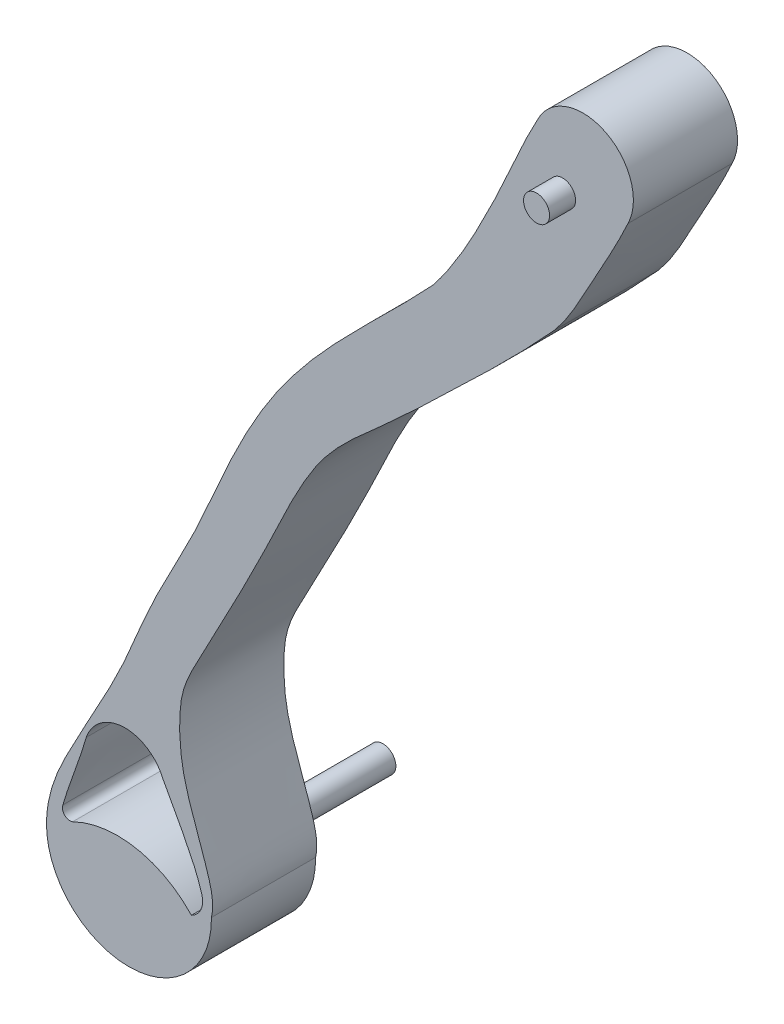
ISO-10303-21;
HEADER;
FILE_DESCRIPTION(('STEP AP214'),'2;1');
FILE_NAME('part.step','',(''),(''),'','','');
FILE_SCHEMA(('AUTOMOTIVE_DESIGN { 1 0 10303 214 1 1 1 1 }'));
ENDSEC;
DATA;
#1=APPLICATION_CONTEXT('core data for automotive mechanical design processes');
#2=APPLICATION_PROTOCOL_DEFINITION('international standard','automotive_design',2000,#1);
#3=PRODUCT_CONTEXT('',#1,'mechanical');
#4=PRODUCT('Part','Part','',(#3));
#5=PRODUCT_RELATED_PRODUCT_CATEGORY('part','',(#4));
#6=PRODUCT_DEFINITION_FORMATION('','',#4);
#7=PRODUCT_DEFINITION_CONTEXT('part definition',#1,'design');
#8=PRODUCT_DEFINITION('design','',#6,#7);
#9=PRODUCT_DEFINITION_SHAPE('','',#8);
#10=(LENGTH_UNIT() NAMED_UNIT(*) SI_UNIT(.MILLI.,.METRE.));
#11=(NAMED_UNIT(*) PLANE_ANGLE_UNIT() SI_UNIT($,.RADIAN.));
#12=(NAMED_UNIT(*) SI_UNIT($,.STERADIAN.) SOLID_ANGLE_UNIT());
#13=UNCERTAINTY_MEASURE_WITH_UNIT(LENGTH_MEASURE(1.E-05),#10,'distance_accuracy_value','');
#14=(GEOMETRIC_REPRESENTATION_CONTEXT(3) GLOBAL_UNCERTAINTY_ASSIGNED_CONTEXT((#13)) GLOBAL_UNIT_ASSIGNED_CONTEXT((#10,
#11,#12)) REPRESENTATION_CONTEXT('',''));
#15=CARTESIAN_POINT('',(0.,0.,0.));
#16=DIRECTION('',(0.,0.,1.));
#17=DIRECTION('',(1.,0.,0.));
#18=AXIS2_PLACEMENT_3D('',#15,#16,#17);
#19=CARTESIAN_POINT('',(60.3871939047688,187.542653548345,40.));
#20=CARTESIAN_POINT('',(55.8290363319542,179.301734235559,40.));
#21=CARTESIAN_POINT('',(48.5414420568133,162.180154607275,40.));
#22=CARTESIAN_POINT('',(36.0717803356837,136.393112865511,40.));
#23=CARTESIAN_POINT('',(26.2480929802239,119.800552758437,40.));
#24=CARTESIAN_POINT('',(19.9390279093565,111.952234191218,40.));
#25=B_SPLINE_CURVE_WITH_KNOTS('',3,(#19,#20,#21,#22,#23,#24),.UNSPECIFIED.,.F.,.F.,(4,1,1,4),
(0.,0.328457342126974,0.649354288135533,1.),.UNSPECIFIED.);
#26=DIRECTION('',(0.,0.,-1.));
#27=VECTOR('',#26,1.);
#28=SURFACE_OF_LINEAR_EXTRUSION('',#25,#27);
#29=CARTESIAN_POINT('',(60.3871939047688,187.542653548345,0.));
#30=CARTESIAN_POINT('',(55.8290363319542,179.301734235559,0.));
#31=CARTESIAN_POINT('',(48.5414420568133,162.180154607275,0.));
#32=CARTESIAN_POINT('',(36.0717803356837,136.393112865511,0.));
#33=CARTESIAN_POINT('',(26.2480929802239,119.800552758437,0.));
#34=CARTESIAN_POINT('',(19.9390279093565,111.952234191218,0.));
#35=B_SPLINE_CURVE_WITH_KNOTS('',3,(#29,#30,#31,#32,#33,#34),.UNSPECIFIED.,.F.,.F.,(4,1,1,4),
(0.,0.328457342126974,0.649354288135533,1.),.UNSPECIFIED.);
#36=CARTESIAN_POINT('',(60.3871939047688,187.542653548345,0.));
#37=VERTEX_POINT('',#36);
#38=CARTESIAN_POINT('',(19.9390279093565,111.952234191218,0.));
#39=VERTEX_POINT('',#38);
#40=EDGE_CURVE('E219',#37,#39,#35,.T.);
#41=ORIENTED_EDGE('',*,*,#40,.T.);
#42=DIRECTION('',(0.,0.,-1.));
#43=VECTOR('',#42,1.);
#44=CARTESIAN_POINT('',(19.9390279093565,111.952234191218,40.));
#45=LINE('',#44,#43);
#46=CARTESIAN_POINT('',(19.9390279093565,111.952234191218,40.));
#47=VERTEX_POINT('',#46);
#48=EDGE_CURVE('E279',#47,#39,#45,.T.);
#49=ORIENTED_EDGE('',*,*,#48,.F.);
#50=CARTESIAN_POINT('',(60.3871939047688,187.542653548345,40.));
#51=VERTEX_POINT('',#50);
#52=EDGE_CURVE('E259',#51,#47,#25,.T.);
#53=ORIENTED_EDGE('',*,*,#52,.F.);
#54=DIRECTION('',(0.,0.,-1.));
#55=VECTOR('',#54,1.);
#56=CARTESIAN_POINT('',(60.3871939047688,187.542653548345,40.));
#57=LINE('',#56,#55);
#58=EDGE_CURVE('E218',#51,#37,#57,.T.);
#59=ORIENTED_EDGE('',*,*,#58,.T.);
#60=EDGE_LOOP('',(#41,#49,#53,#59));
#61=FACE_BOUND('',#60,.T.);
#62=ADVANCED_FACE('F41',(#61),#28,.F.);
#63=CARTESIAN_POINT('',(19.9390279093565,111.952234191218,40.));
#64=CARTESIAN_POINT('',(3.65232556956879,94.3290387479032,40.));
#65=CARTESIAN_POINT('',(-20.2496056722117,73.6219313673964,40.));
#66=CARTESIAN_POINT('',(-45.6524290616376,39.0411420736974,40.));
#67=CARTESIAN_POINT('',(-58.8426468973011,13.6097033064801,40.));
#68=CARTESIAN_POINT('',(-71.7894873232042,-18.0719905640691,40.));
#69=CARTESIAN_POINT('',(-87.738861669202,-45.500334261071,40.));
#70=CARTESIAN_POINT('',(-100.863433522927,-79.9213549862569,40.));
#71=CARTESIAN_POINT('',(-115.452059141126,-103.788445803052,40.));
#72=CARTESIAN_POINT('',(-126.143907941595,-125.769991296804,40.));
#73=CARTESIAN_POINT('',(-128.340182149036,-135.353702394417,40.));
#74=CARTESIAN_POINT('',(-128.435303346591,-140.896902452704,40.));
#75=B_SPLINE_CURVE_WITH_KNOTS('',3,(#63,#64,#65,#66,#67,#68,#69,#70,#71,#72,#73,#74),
.UNSPECIFIED.,.F.,.F.,(4,1,1,1,1,1,1,1,1,4),(0.,0.227860935563209,0.297082932040431,
0.405625713010245,0.49841550509689,0.621398377971298,0.705377541129316,0.846798383266303,
0.885360920028116,0.937345031613258),.UNSPECIFIED.);
#76=DIRECTION('',(0.,0.,-1.));
#77=VECTOR('',#76,1.);
#78=SURFACE_OF_LINEAR_EXTRUSION('',#75,#77);
#79=CARTESIAN_POINT('',(19.9390279093565,111.952234191218,0.));
#80=CARTESIAN_POINT('',(3.65232556956879,94.3290387479032,0.));
#81=CARTESIAN_POINT('',(-20.2496056722117,73.6219313673964,0.));
#82=CARTESIAN_POINT('',(-45.6524290616376,39.0411420736974,0.));
#83=CARTESIAN_POINT('',(-58.8426468973011,13.6097033064801,0.));
#84=CARTESIAN_POINT('',(-71.7894873232042,-18.0719905640691,0.));
#85=CARTESIAN_POINT('',(-87.738861669202,-45.500334261071,0.));
#86=CARTESIAN_POINT('',(-100.863433522927,-79.9213549862569,0.));
#87=CARTESIAN_POINT('',(-115.452059141126,-103.788445803052,0.));
#88=CARTESIAN_POINT('',(-126.143907941595,-125.769991296804,0.));
#89=CARTESIAN_POINT('',(-128.340182149036,-135.353702394417,0.));
#90=CARTESIAN_POINT('',(-128.435303346591,-140.896902452704,0.));
#91=B_SPLINE_CURVE_WITH_KNOTS('',3,(#79,#80,#81,#82,#83,#84,#85,#86,#87,#88,#89,#90),
.UNSPECIFIED.,.F.,.F.,(4,1,1,1,1,1,1,1,1,4),(0.,0.227860935563209,0.297082932040431,
0.405625713010245,0.49841550509689,0.621398377971298,0.705377541129316,0.846798383266303,
0.885360920028116,0.937345031613258),.UNSPECIFIED.);
#92=CARTESIAN_POINT('',(-128.435303346591,-140.896902452704,0.));
#93=VERTEX_POINT('',#92);
#94=EDGE_CURVE('E225',#39,#93,#91,.T.);
#95=ORIENTED_EDGE('',*,*,#94,.T.);
#96=DIRECTION('',(0.,0.,-1.));
#97=VECTOR('',#96,1.);
#98=CARTESIAN_POINT('',(-128.435303346591,-140.896902452704,40.));
#99=LINE('',#98,#97);
#100=CARTESIAN_POINT('',(-128.435303346591,-140.896902452704,40.));
#101=VERTEX_POINT('',#100);
#102=EDGE_CURVE('E275',#101,#93,#99,.T.);
#103=ORIENTED_EDGE('',*,*,#102,.F.);
#104=EDGE_CURVE('E320',#47,#101,#75,.T.);
#105=ORIENTED_EDGE('',*,*,#104,.F.);
#106=ORIENTED_EDGE('',*,*,#48,.T.);
#107=EDGE_LOOP('',(#95,#103,#105,#106));
#108=FACE_BOUND('',#107,.T.);
#109=ADVANCED_FACE('F319',(#108),#78,.F.);
#110=CARTESIAN_POINT('',(-96.7551495256795,-141.440533232487,40.));
#111=DIRECTION('',(0.,0.,-1.));
#112=DIRECTION('',(-1.,0.,0.));
#113=AXIS2_PLACEMENT_3D('',#110,#111,#112);
#114=CYLINDRICAL_SURFACE('',#113,31.6848178240202);
#115=CARTESIAN_POINT('',(-96.7551495256795,-141.440533232487,0.));
#116=DIRECTION('',(0.,0.,1.));
#117=DIRECTION('',(1.,0.,0.));
#118=AXIS2_PLACEMENT_3D('',#115,#116,#117);
#119=CIRCLE('',#118,31.6848178240202);
#120=CARTESIAN_POINT('',(-65.0749957047679,-140.896902452704,0.));
#121=VERTEX_POINT('',#120);
#122=EDGE_CURVE('E234',#93,#121,#119,.T.);
#123=ORIENTED_EDGE('',*,*,#122,.T.);
#124=DIRECTION('',(0.,0.,-1.));
#125=VECTOR('',#124,1.);
#126=CARTESIAN_POINT('',(-65.0749957047679,-140.896902452704,40.));
#127=LINE('',#126,#125);
#128=CARTESIAN_POINT('',(-65.0749957047679,-140.896902452704,40.));
#129=VERTEX_POINT('',#128);
#130=EDGE_CURVE('E271',#129,#121,#127,.T.);
#131=ORIENTED_EDGE('',*,*,#130,.F.);
#132=CARTESIAN_POINT('',(-96.7551495256795,-141.440533232487,40.));
#133=DIRECTION('',(0.,0.,1.));
#134=DIRECTION('',(1.,0.,0.));
#135=AXIS2_PLACEMENT_3D('',#132,#133,#134);
#136=CIRCLE('',#135,31.6848178240202);
#137=EDGE_CURVE('E316',#101,#129,#136,.T.);
#138=ORIENTED_EDGE('',*,*,#137,.F.);
#139=ORIENTED_EDGE('',*,*,#102,.T.);
#140=EDGE_LOOP('',(#123,#131,#138,#139));
#141=FACE_BOUND('',#140,.T.);
#142=ADVANCED_FACE('F315',(#141),#114,.T.);
#143=CARTESIAN_POINT('',(-65.0749957047679,-140.896902452704,40.));
#144=CARTESIAN_POINT('',(-63.9076520974631,-135.874645519981,40.));
#145=CARTESIAN_POINT('',(-66.351009120268,-126.659238678966,40.));
#146=CARTESIAN_POINT('',(-71.697657004547,-112.128089654056,40.));
#147=CARTESIAN_POINT('',(-76.3347123156339,-98.4722093976341,40.));
#148=CARTESIAN_POINT('',(-77.5417094464005,-84.2071987317642,40.));
#149=CARTESIAN_POINT('',(-76.9619608186878,-70.3420925391163,40.));
#150=CARTESIAN_POINT('',(-68.8857927603554,-55.6949594400587,40.));
#151=CARTESIAN_POINT('',(-58.2138452567508,-35.3055248491132,40.));
#152=CARTESIAN_POINT('',(-45.109839413962,-10.2853251386272,40.));
#153=CARTESIAN_POINT('',(-33.8512418556575,14.9392911187335,40.));
#154=CARTESIAN_POINT('',(-19.441261207989,38.761764832245,40.));
#155=CARTESIAN_POINT('',(0.346111339632618,54.84625305736,40.));
#156=CARTESIAN_POINT('',(30.1496907967711,83.3530804332558,40.));
#157=CARTESIAN_POINT('',(52.0052503732417,104.15599097624,40.));
#158=CARTESIAN_POINT('',(66.8758658751505,120.550338304471,40.));
#159=B_SPLINE_CURVE_WITH_KNOTS('',3,(#143,#144,#145,#146,#147,#148,#149,#150,#151,#152,#153,
#154,#155,#156,#157,#158),.UNSPECIFIED.,.F.,.F.,(4,1,1,1,1,1,1,1,1,1,1,1,1,4),(0.,
0.046869520106327,0.0901417125794342,0.14858122636721,0.183456914359763,0.226900489242656,
0.278590853817405,0.340349479488274,0.448130788079936,0.547901996865662,0.604794059024926,
0.712230619265801,0.788345355237952,1.),.UNSPECIFIED.);
#160=DIRECTION('',(0.,0.,-1.));
#161=VECTOR('',#160,1.);
#162=SURFACE_OF_LINEAR_EXTRUSION('',#159,#161);
#163=CARTESIAN_POINT('',(-65.0749957047679,-140.896902452704,0.));
#164=CARTESIAN_POINT('',(-63.9076520974631,-135.874645519981,0.));
#165=CARTESIAN_POINT('',(-66.351009120268,-126.659238678966,0.));
#166=CARTESIAN_POINT('',(-71.697657004547,-112.128089654056,0.));
#167=CARTESIAN_POINT('',(-76.3347123156339,-98.4722093976341,0.));
#168=CARTESIAN_POINT('',(-77.5417094464005,-84.2071987317642,0.));
#169=CARTESIAN_POINT('',(-76.9619608186878,-70.3420925391163,0.));
#170=CARTESIAN_POINT('',(-68.8857927603554,-55.6949594400587,0.));
#171=CARTESIAN_POINT('',(-58.2138452567508,-35.3055248491132,0.));
#172=CARTESIAN_POINT('',(-45.109839413962,-10.2853251386272,0.));
#173=CARTESIAN_POINT('',(-33.8512418556575,14.9392911187335,0.));
#174=CARTESIAN_POINT('',(-19.441261207989,38.761764832245,0.));
#175=CARTESIAN_POINT('',(0.346111339632618,54.84625305736,0.));
#176=CARTESIAN_POINT('',(30.1496907967711,83.3530804332558,0.));
#177=CARTESIAN_POINT('',(52.0052503732417,104.15599097624,0.));
#178=CARTESIAN_POINT('',(66.8758658751505,120.550338304471,0.));
#179=B_SPLINE_CURVE_WITH_KNOTS('',3,(#163,#164,#165,#166,#167,#168,#169,#170,#171,#172,#173,
#174,#175,#176,#177,#178),.UNSPECIFIED.,.F.,.F.,(4,1,1,1,1,1,1,1,1,1,1,1,1,4),(0.,
0.046869520106327,0.0901417125794342,0.14858122636721,0.183456914359763,0.226900489242656,
0.278590853817405,0.340349479488274,0.448130788079936,0.547901996865662,0.604794059024926,
0.712230619265801,0.788345355237952,1.),.UNSPECIFIED.);
#180=CARTESIAN_POINT('',(66.8758658751505,120.550338304471,0.));
#181=VERTEX_POINT('',#180);
#182=EDGE_CURVE('E240',#121,#181,#179,.T.);
#183=ORIENTED_EDGE('',*,*,#182,.T.);
#184=DIRECTION('',(0.,0.,-1.));
#185=VECTOR('',#184,1.);
#186=CARTESIAN_POINT('',(66.8758658751505,120.550338304471,40.));
#187=LINE('',#186,#185);
#188=CARTESIAN_POINT('',(66.8758658751505,120.550338304471,40.));
#189=VERTEX_POINT('',#188);
#190=EDGE_CURVE('E267',#189,#181,#187,.T.);
#191=ORIENTED_EDGE('',*,*,#190,.F.);
#192=EDGE_CURVE('E208',#129,#189,#159,.T.);
#193=ORIENTED_EDGE('',*,*,#192,.F.);
#194=ORIENTED_EDGE('',*,*,#130,.T.);
#195=EDGE_LOOP('',(#183,#191,#193,#194));
#196=FACE_BOUND('',#195,.T.);
#197=ADVANCED_FACE('F197',(#196),#162,.F.);
#198=CARTESIAN_POINT('',(66.8758658751505,120.550338304471,40.));
#199=CARTESIAN_POINT('',(72.3865565632837,127.199137849792,40.));
#200=CARTESIAN_POINT('',(81.1017354369889,144.070801532341,40.));
#201=CARTESIAN_POINT('',(90.5875806479653,160.476032838296,40.));
#202=CARTESIAN_POINT('',(94.8964834466866,169.931016126953,40.));
#203=B_SPLINE_CURVE_WITH_KNOTS('',3,(#198,#199,#200,#201,#202),.UNSPECIFIED.,.F.,.F.,(4,1,4),
(0.,0.452321954450855,1.),.UNSPECIFIED.);
#204=DIRECTION('',(0.,0.,-1.));
#205=VECTOR('',#204,1.);
#206=SURFACE_OF_LINEAR_EXTRUSION('',#203,#205);
#207=CARTESIAN_POINT('',(66.8758658751505,120.550338304471,0.));
#208=CARTESIAN_POINT('',(72.3865565632837,127.199137849792,0.));
#209=CARTESIAN_POINT('',(81.1017354369889,144.070801532341,0.));
#210=CARTESIAN_POINT('',(90.5875806479653,160.476032838296,0.));
#211=CARTESIAN_POINT('',(94.8964834466866,169.931016126953,0.));
#212=B_SPLINE_CURVE_WITH_KNOTS('',3,(#207,#208,#209,#210,#211),.UNSPECIFIED.,.F.,.F.,(4,1,4),
(0.,0.452321954450855,1.),.UNSPECIFIED.);
#213=CARTESIAN_POINT('',(94.8964834466866,169.931016126953,0.));
#214=VERTEX_POINT('',#213);
#215=EDGE_CURVE('E245',#181,#214,#212,.T.);
#216=ORIENTED_EDGE('',*,*,#215,.T.);
#217=DIRECTION('',(0.,0.,-1.));
#218=VECTOR('',#217,1.);
#219=CARTESIAN_POINT('',(94.8964834466866,169.931016126953,40.));
#220=LINE('',#219,#218);
#221=CARTESIAN_POINT('',(94.8964834466866,169.931016126953,40.));
#222=VERTEX_POINT('',#221);
#223=EDGE_CURVE('E263',#222,#214,#220,.T.);
#224=ORIENTED_EDGE('',*,*,#223,.F.);
#225=EDGE_CURVE('E201',#189,#222,#203,.T.);
#226=ORIENTED_EDGE('',*,*,#225,.F.);
#227=ORIENTED_EDGE('',*,*,#190,.T.);
#228=EDGE_LOOP('',(#216,#224,#226,#227));
#229=FACE_BOUND('',#228,.T.);
#230=ADVANCED_FACE('F192',(#229),#206,.F.);
#231=CARTESIAN_POINT('',(77.6418386757277,178.736834837649,40.));
#232=DIRECTION('',(0.,0.,-1.));
#233=DIRECTION('',(-1.,0.,0.));
#234=AXIS2_PLACEMENT_3D('',#231,#232,#233);
#235=CYLINDRICAL_SURFACE('',#234,19.3717631964059);
#236=CARTESIAN_POINT('',(77.6418386757277,178.736834837649,0.));
#237=DIRECTION('',(0.,0.,1.));
#238=DIRECTION('',(1.,0.,0.));
#239=AXIS2_PLACEMENT_3D('',#236,#237,#238);
#240=CIRCLE('',#239,19.3717631964059);
#241=EDGE_CURVE('E253',#214,#37,#240,.T.);
#242=ORIENTED_EDGE('',*,*,#241,.T.);
#243=ORIENTED_EDGE('',*,*,#58,.F.);
#244=CARTESIAN_POINT('',(77.6418386757277,178.736834837649,40.));
#245=DIRECTION('',(0.,0.,1.));
#246=DIRECTION('',(1.,0.,0.));
#247=AXIS2_PLACEMENT_3D('',#244,#245,#246);
#248=CIRCLE('',#247,19.3717631964059);
#249=EDGE_CURVE('E207',#222,#51,#248,.T.);
#250=ORIENTED_EDGE('',*,*,#249,.F.);
#251=ORIENTED_EDGE('',*,*,#223,.T.);
#252=EDGE_LOOP('',(#242,#243,#250,#251));
#253=FACE_BOUND('',#252,.T.);
#254=ADVANCED_FACE('F186',(#253),#235,.T.);
#255=CARTESIAN_POINT('',(41.9594234862686,148.749008778062,40.));
#256=DIRECTION('',(0.,0.,-1.));
#257=DIRECTION('',(-1.,0.,0.));
#258=AXIS2_PLACEMENT_3D('',#255,#256,#257);
#259=PLANE('',#258);
#260=CARTESIAN_POINT('',(-98.2680109010432,-110.139148104307,40.));
#261=DIRECTION('',(0.,0.,-1.));
#262=DIRECTION('',(-1.,0.,0.));
#263=AXIS2_PLACEMENT_3D('',#260,#261,#262);
#264=CIRCLE('',#263,15.7577300745778);
#265=CARTESIAN_POINT('',(-113.174364561703,-105.029678694809,40.));
#266=VERTEX_POINT('',#265);
#267=CARTESIAN_POINT('',(-83.767621929173,-103.971103295154,40.));
#268=VERTEX_POINT('',#267);
#269=EDGE_CURVE('E140',#266,#268,#264,.T.);
#270=ORIENTED_EDGE('',*,*,#269,.T.);
#271=CARTESIAN_POINT('',(-83.767621929173,-103.971103295154,40.));
#272=CARTESIAN_POINT('',(-83.5873518221978,-104.298739765715,40.));
#273=CARTESIAN_POINT('',(-81.9140125138247,-107.339065994013,40.));
#274=CARTESIAN_POINT('',(-79.5056807611094,-111.713780783624,40.));
#275=CARTESIAN_POINT('',(-76.6247828079274,-117.103856722549,40.));
#276=CARTESIAN_POINT('',(-74.5149876082828,-121.165521306411,40.));
#277=CARTESIAN_POINT('',(-72.5233715707377,-125.181904734384,40.));
#278=CARTESIAN_POINT('',(-70.7511149933077,-129.174468609595,40.));
#279=CARTESIAN_POINT('',(-69.5361784966292,-132.477867127564,40.));
#280=CARTESIAN_POINT('',(-68.9335514776586,-134.470064330966,40.));
#281=CARTESIAN_POINT('',(-68.756079477371,-135.101198343125,40.));
#282=B_SPLINE_CURVE_WITH_KNOTS('',3,(#271,#272,#273,#274,#275,#276,#277,#278,#279,#280,#281),
.UNSPECIFIED.,.F.,.F.,(4,1,1,1,1,1,1,1,4),(0.78726205462932,0.790799640659053,0.820108718849894,
0.834763257945314,0.849417797040735,0.864072336136155,0.878726875231576,0.893381414326996,
0.900142659372409),.UNSPECIFIED.);
#283=CARTESIAN_POINT('',(-68.756079477371,-135.101198343125,40.));
#284=VERTEX_POINT('',#283);
#285=EDGE_CURVE('E133',#268,#284,#282,.T.);
#286=ORIENTED_EDGE('',*,*,#285,.T.);
#287=CARTESIAN_POINT('',(-76.0350356200496,-137.174185438122,40.));
#288=DIRECTION('',(0.,0.,-1.));
#289=DIRECTION('',(-1.,0.,0.));
#290=AXIS2_PLACEMENT_3D('',#287,#288,#289);
#291=CIRCLE('',#290,7.56838675168399);
#292=CARTESIAN_POINT('',(-72.7671763250433,-144.000719965326,40.));
#293=VERTEX_POINT('',#292);
#294=EDGE_CURVE('E143',#284,#293,#291,.T.);
#295=ORIENTED_EDGE('',*,*,#294,.T.);
#296=CARTESIAN_POINT('',(-101.151055014439,-170.490756136762,40.));
#297=DIRECTION('',(0.,0.,1.));
#298=DIRECTION('',(-1.,0.,0.));
#299=AXIS2_PLACEMENT_3D('',#296,#297,#298);
#300=CIRCLE('',#299,38.8248191987845);
#301=CARTESIAN_POINT('',(-118.409854589952,-135.71288353031,40.));
#302=VERTEX_POINT('',#301);
#303=EDGE_CURVE('E57',#293,#302,#300,.T.);
#304=ORIENTED_EDGE('',*,*,#303,.T.);
#305=CARTESIAN_POINT('',(-119.395416627931,-132.968075227075,40.));
#306=DIRECTION('',(0.,0.,-1.));
#307=DIRECTION('',(-1.,0.,0.));
#308=AXIS2_PLACEMENT_3D('',#305,#306,#307);
#309=CIRCLE('',#308,2.91638563160215);
#310=CARTESIAN_POINT('',(-122.117435387313,-131.921213714845,40.));
#311=VERTEX_POINT('',#310);
#312=EDGE_CURVE('E493',#302,#311,#309,.T.);
#313=ORIENTED_EDGE('',*,*,#312,.T.);
#314=CARTESIAN_POINT('',(-122.117435387313,-131.921213714845,40.));
#315=CARTESIAN_POINT('',(-121.902241698116,-131.121274345062,40.));
#316=CARTESIAN_POINT('',(-121.440830196153,-129.57026566349,40.));
#317=CARTESIAN_POINT('',(-120.671868024191,-127.192672605094,40.));
#318=CARTESIAN_POINT('',(-119.652569306588,-124.170271778331,40.));
#319=CARTESIAN_POINT('',(-118.30466128808,-120.363805325728,40.));
#320=CARTESIAN_POINT('',(-116.083389287069,-114.194015199901,40.));
#321=CARTESIAN_POINT('',(-114.313518516747,-109.046051234717,40.));
#322=CARTESIAN_POINT('',(-113.271974892819,-105.380725172154,40.));
#323=CARTESIAN_POINT('',(-113.174364561703,-105.029678694809,40.));
#324=B_SPLINE_CURVE_WITH_KNOTS('',3,(#314,#315,#316,#317,#318,#319,#320,#321,#322,#323),
.UNSPECIFIED.,.F.,.F.,(4,1,1,1,1,1,1,4),(0.0361999933541439,0.0449983752809423,
0.0528232545126927,0.0606481337444431,0.0762978922079439,0.0919476506714447,0.123247167598446,
0.126550228804812),.UNSPECIFIED.);
#325=EDGE_CURVE('E486',#311,#266,#324,.T.);
#326=ORIENTED_EDGE('',*,*,#325,.T.);
#327=EDGE_LOOP('',(#270,#286,#295,#304,#313,#326));
#328=FACE_BOUND('',#327,.T.);
#329=CARTESIAN_POINT('',(69.8193877085274,167.582956348483,40.));
#330=DIRECTION('',(0.,0.,-1.));
#331=DIRECTION('',(-1.,0.,0.));
#332=AXIS2_PLACEMENT_3D('',#329,#330,#331);
#333=CIRCLE('',#332,5.00000000000001);
#334=CARTESIAN_POINT('',(64.8193877085274,167.582956348483,40.));
#335=VERTEX_POINT('',#334);
#336=EDGE_CURVE('E283',#335,#335,#333,.F.);
#337=ORIENTED_EDGE('',*,*,#336,.F.);
#338=EDGE_LOOP('',(#337));
#339=FACE_BOUND('',#338,.T.);
#340=ORIENTED_EDGE('',*,*,#52,.T.);
#341=ORIENTED_EDGE('',*,*,#104,.T.);
#342=ORIENTED_EDGE('',*,*,#137,.T.);
#343=ORIENTED_EDGE('',*,*,#192,.T.);
#344=ORIENTED_EDGE('',*,*,#225,.T.);
#345=ORIENTED_EDGE('',*,*,#249,.T.);
#346=EDGE_LOOP('',(#340,#341,#342,#343,#344,#345));
#347=FACE_BOUND('',#346,.T.);
#348=ADVANCED_FACE('F148',(#328,#339,#347),#259,.F.);
#349=CARTESIAN_POINT('',(41.9594234862686,148.749008778062,0.));
#350=DIRECTION('',(0.,0.,-1.));
#351=DIRECTION('',(-1.,0.,0.));
#352=AXIS2_PLACEMENT_3D('',#349,#350,#351);
#353=PLANE('',#352);
#354=CARTESIAN_POINT('',(-99.2300932035587,-155.129512748989,0.));
#355=DIRECTION('',(0.,0.,-1.));
#356=DIRECTION('',(-1.,0.,0.));
#357=AXIS2_PLACEMENT_3D('',#354,#355,#356);
#358=CIRCLE('',#357,5.00000000000001);
#359=CARTESIAN_POINT('',(-104.230093203559,-155.129512748989,0.));
#360=VERTEX_POINT('',#359);
#361=EDGE_CURVE('E11',#360,#360,#358,.T.);
#362=ORIENTED_EDGE('',*,*,#361,.F.);
#363=EDGE_LOOP('',(#362));
#364=FACE_BOUND('',#363,.T.);
#365=CARTESIAN_POINT('',(69.8193877085274,167.582956348483,0.));
#366=DIRECTION('',(0.,0.,-1.));
#367=DIRECTION('',(-1.,0.,0.));
#368=AXIS2_PLACEMENT_3D('',#365,#366,#367);
#369=CIRCLE('',#368,5.00000000000001);
#370=CARTESIAN_POINT('',(64.8193877085274,167.582956348483,0.));
#371=VERTEX_POINT('',#370);
#372=EDGE_CURVE('E50',#371,#371,#369,.T.);
#373=ORIENTED_EDGE('',*,*,#372,.F.);
#374=EDGE_LOOP('',(#373));
#375=FACE_BOUND('',#374,.T.);
#376=CARTESIAN_POINT('',(-83.767621929173,-103.971103295154,0.));
#377=CARTESIAN_POINT('',(-83.5873518221978,-104.298739765715,0.));
#378=CARTESIAN_POINT('',(-81.9140125138247,-107.339065994013,0.));
#379=CARTESIAN_POINT('',(-79.5056807611094,-111.713780783624,0.));
#380=CARTESIAN_POINT('',(-76.6247828079274,-117.103856722549,0.));
#381=CARTESIAN_POINT('',(-74.5149876082828,-121.165521306411,0.));
#382=CARTESIAN_POINT('',(-72.5233715707377,-125.181904734384,0.));
#383=CARTESIAN_POINT('',(-70.7511149933077,-129.174468609595,0.));
#384=CARTESIAN_POINT('',(-69.5361784966292,-132.477867127564,0.));
#385=CARTESIAN_POINT('',(-68.9335514776586,-134.470064330966,0.));
#386=CARTESIAN_POINT('',(-68.756079477371,-135.101198343125,0.));
#387=B_SPLINE_CURVE_WITH_KNOTS('',3,(#376,#377,#378,#379,#380,#381,#382,#383,#384,#385,#386),
.UNSPECIFIED.,.F.,.F.,(4,1,1,1,1,1,1,1,4),(0.78726205462932,0.790799640659053,0.820108718849894,
0.834763257945314,0.849417797040735,0.864072336136155,0.878726875231576,0.893381414326996,
0.900142659372409),.UNSPECIFIED.);
#388=CARTESIAN_POINT('',(-83.767621929173,-103.971103295154,0.));
#389=VERTEX_POINT('',#388);
#390=CARTESIAN_POINT('',(-68.756079477371,-135.101198343125,0.));
#391=VERTEX_POINT('',#390);
#392=EDGE_CURVE('E65',#389,#391,#387,.T.);
#393=ORIENTED_EDGE('',*,*,#392,.F.);
#394=CARTESIAN_POINT('',(-98.2680109010432,-110.139148104307,0.));
#395=DIRECTION('',(0.,0.,-1.));
#396=DIRECTION('',(-1.,0.,0.));
#397=AXIS2_PLACEMENT_3D('',#394,#395,#396);
#398=CIRCLE('',#397,15.7577300745778);
#399=CARTESIAN_POINT('',(-113.174364561703,-105.029678694809,0.));
#400=VERTEX_POINT('',#399);
#401=EDGE_CURVE('E153',#400,#389,#398,.T.);
#402=ORIENTED_EDGE('',*,*,#401,.F.);
#403=CARTESIAN_POINT('',(-122.117435387313,-131.921213714845,0.));
#404=CARTESIAN_POINT('',(-121.902241698116,-131.121274345062,0.));
#405=CARTESIAN_POINT('',(-121.440830196153,-129.57026566349,0.));
#406=CARTESIAN_POINT('',(-120.671868024191,-127.192672605094,0.));
#407=CARTESIAN_POINT('',(-119.652569306588,-124.170271778331,0.));
#408=CARTESIAN_POINT('',(-118.30466128808,-120.363805325728,0.));
#409=CARTESIAN_POINT('',(-116.083389287069,-114.194015199901,0.));
#410=CARTESIAN_POINT('',(-114.313518516747,-109.046051234717,0.));
#411=CARTESIAN_POINT('',(-113.271974892819,-105.380725172154,0.));
#412=CARTESIAN_POINT('',(-113.174364561703,-105.029678694809,0.));
#413=B_SPLINE_CURVE_WITH_KNOTS('',3,(#403,#404,#405,#406,#407,#408,#409,#410,#411,#412),
.UNSPECIFIED.,.F.,.F.,(4,1,1,1,1,1,1,4),(0.0361999933541439,0.0449983752809423,
0.0528232545126927,0.0606481337444431,0.0762978922079439,0.0919476506714447,0.123247167598446,
0.126550228804812),.UNSPECIFIED.);
#414=CARTESIAN_POINT('',(-122.117435387313,-131.921213714845,0.));
#415=VERTEX_POINT('',#414);
#416=EDGE_CURVE('E157',#415,#400,#413,.T.);
#417=ORIENTED_EDGE('',*,*,#416,.F.);
#418=CARTESIAN_POINT('',(-119.395416627931,-132.968075227075,0.));
#419=DIRECTION('',(0.,0.,-1.));
#420=DIRECTION('',(-1.,0.,0.));
#421=AXIS2_PLACEMENT_3D('',#418,#419,#420);
#422=CIRCLE('',#421,2.91638563160215);
#423=CARTESIAN_POINT('',(-118.409854589952,-135.71288353031,0.));
#424=VERTEX_POINT('',#423);
#425=EDGE_CURVE('E513',#424,#415,#422,.T.);
#426=ORIENTED_EDGE('',*,*,#425,.F.);
#427=CARTESIAN_POINT('',(-101.151055014439,-170.490756136762,0.));
#428=DIRECTION('',(0.,0.,1.));
#429=DIRECTION('',(-1.,0.,0.));
#430=AXIS2_PLACEMENT_3D('',#427,#428,#429);
#431=CIRCLE('',#430,38.8248191987845);
#432=CARTESIAN_POINT('',(-72.7671763250433,-144.000719965326,0.));
#433=VERTEX_POINT('',#432);
#434=EDGE_CURVE('E509',#433,#424,#431,.T.);
#435=ORIENTED_EDGE('',*,*,#434,.F.);
#436=CARTESIAN_POINT('',(-76.0350356200496,-137.174185438122,0.));
#437=DIRECTION('',(0.,0.,-1.));
#438=DIRECTION('',(-1.,0.,0.));
#439=AXIS2_PLACEMENT_3D('',#436,#437,#438);
#440=CIRCLE('',#439,7.56838675168399);
#441=EDGE_CURVE('E503',#391,#433,#440,.T.);
#442=ORIENTED_EDGE('',*,*,#441,.F.);
#443=EDGE_LOOP('',(#393,#402,#417,#426,#435,#442));
#444=FACE_BOUND('',#443,.T.);
#445=ORIENTED_EDGE('',*,*,#40,.F.);
#446=ORIENTED_EDGE('',*,*,#241,.F.);
#447=ORIENTED_EDGE('',*,*,#215,.F.);
#448=ORIENTED_EDGE('',*,*,#182,.F.);
#449=ORIENTED_EDGE('',*,*,#122,.F.);
#450=ORIENTED_EDGE('',*,*,#94,.F.);
#451=EDGE_LOOP('',(#445,#446,#447,#448,#449,#450));
#452=FACE_BOUND('',#451,.T.);
#453=ADVANCED_FACE('F182',(#364,#375,#444,#452),#353,.T.);
#454=CARTESIAN_POINT('',(69.8193877085274,167.582956348483,50.));
#455=DIRECTION('',(0.,0.,-1.));
#456=DIRECTION('',(-1.,0.,0.));
#457=AXIS2_PLACEMENT_3D('',#454,#455,#456);
#458=CYLINDRICAL_SURFACE('',#457,5.00000000000001);
#459=CARTESIAN_POINT('',(69.8193877085274,167.582956348483,50.));
#460=DIRECTION('',(0.,0.,1.));
#461=DIRECTION('',(1.,0.,0.));
#462=AXIS2_PLACEMENT_3D('',#459,#460,#461);
#463=CIRCLE('',#462,5.00000000000001);
#464=CARTESIAN_POINT('',(74.8193877085274,167.582956348483,50.));
#465=VERTEX_POINT('',#464);
#466=EDGE_CURVE('E226',#465,#465,#463,.T.);
#467=ORIENTED_EDGE('',*,*,#466,.F.);
#468=EDGE_LOOP('',(#467));
#469=FACE_BOUND('',#468,.T.);
#470=ORIENTED_EDGE('',*,*,#336,.T.);
#471=EDGE_LOOP('',(#470));
#472=FACE_BOUND('',#471,.T.);
#473=ADVANCED_FACE('F178',(#469,#472),#458,.T.);
#474=CARTESIAN_POINT('',(69.8193877085274,167.582956348483,50.));
#475=DIRECTION('',(0.,0.,1.));
#476=DIRECTION('',(1.,0.,0.));
#477=AXIS2_PLACEMENT_3D('',#474,#475,#476);
#478=PLANE('',#477);
#479=ORIENTED_EDGE('',*,*,#466,.T.);
#480=EDGE_LOOP('',(#479));
#481=FACE_BOUND('',#480,.T.);
#482=ADVANCED_FACE('F174',(#481),#478,.T.);
#483=DIRECTION('',(0.,0.,-1.));
#484=VECTOR('',#483,1.);
#485=SURFACE_OF_LINEAR_EXTRUSION('',#282,#484);
#486=ORIENTED_EDGE('',*,*,#392,.T.);
#487=DIRECTION('',(0.,0.,-1.));
#488=VECTOR('',#487,1.);
#489=CARTESIAN_POINT('',(-68.756079477371,-135.101198343125,40.));
#490=LINE('',#489,#488);
#491=EDGE_CURVE('E129',#284,#391,#490,.T.);
#492=ORIENTED_EDGE('',*,*,#491,.F.);
#493=ORIENTED_EDGE('',*,*,#285,.F.);
#494=DIRECTION('',(0.,0.,-1.));
#495=VECTOR('',#494,1.);
#496=CARTESIAN_POINT('',(-83.767621929173,-103.971103295154,40.));
#497=LINE('',#496,#495);
#498=EDGE_CURVE('E525',#268,#389,#497,.T.);
#499=ORIENTED_EDGE('',*,*,#498,.T.);
#500=EDGE_LOOP('',(#486,#492,#493,#499));
#501=FACE_BOUND('',#500,.T.);
#502=ADVANCED_FACE('F131',(#501),#485,.F.);
#503=CARTESIAN_POINT('',(-98.2680109010432,-110.139148104307,40.));
#504=DIRECTION('',(0.,0.,-1.));
#505=DIRECTION('',(-1.,0.,0.));
#506=AXIS2_PLACEMENT_3D('',#503,#504,#505);
#507=CYLINDRICAL_SURFACE('',#506,15.7577300745778);
#508=ORIENTED_EDGE('',*,*,#401,.T.);
#509=ORIENTED_EDGE('',*,*,#498,.F.);
#510=ORIENTED_EDGE('',*,*,#269,.F.);
#511=DIRECTION('',(0.,0.,-1.));
#512=VECTOR('',#511,1.);
#513=CARTESIAN_POINT('',(-113.174364561703,-105.029678694809,40.));
#514=LINE('',#513,#512);
#515=EDGE_CURVE('E528',#266,#400,#514,.T.);
#516=ORIENTED_EDGE('',*,*,#515,.T.);
#517=EDGE_LOOP('',(#508,#509,#510,#516));
#518=FACE_BOUND('',#517,.T.);
#519=ADVANCED_FACE('F173',(#518),#507,.F.);
#520=DIRECTION('',(0.,0.,-1.));
#521=VECTOR('',#520,1.);
#522=SURFACE_OF_LINEAR_EXTRUSION('',#324,#521);
#523=ORIENTED_EDGE('',*,*,#416,.T.);
#524=ORIENTED_EDGE('',*,*,#515,.F.);
#525=ORIENTED_EDGE('',*,*,#325,.F.);
#526=DIRECTION('',(0.,0.,-1.));
#527=VECTOR('',#526,1.);
#528=CARTESIAN_POINT('',(-122.117435387313,-131.921213714845,40.));
#529=LINE('',#528,#527);
#530=EDGE_CURVE('E531',#311,#415,#529,.T.);
#531=ORIENTED_EDGE('',*,*,#530,.T.);
#532=EDGE_LOOP('',(#523,#524,#525,#531));
#533=FACE_BOUND('',#532,.T.);
#534=ADVANCED_FACE('F403',(#533),#522,.F.);
#535=CARTESIAN_POINT('',(-119.395416627931,-132.968075227075,40.));
#536=DIRECTION('',(0.,0.,-1.));
#537=DIRECTION('',(-1.,0.,0.));
#538=AXIS2_PLACEMENT_3D('',#535,#536,#537);
#539=CYLINDRICAL_SURFACE('',#538,2.91638563160215);
#540=ORIENTED_EDGE('',*,*,#425,.T.);
#541=ORIENTED_EDGE('',*,*,#530,.F.);
#542=ORIENTED_EDGE('',*,*,#312,.F.);
#543=DIRECTION('',(0.,0.,-1.));
#544=VECTOR('',#543,1.);
#545=CARTESIAN_POINT('',(-118.409854589952,-135.71288353031,40.));
#546=LINE('',#545,#544);
#547=EDGE_CURVE('E534',#302,#424,#546,.T.);
#548=ORIENTED_EDGE('',*,*,#547,.T.);
#549=EDGE_LOOP('',(#540,#541,#542,#548));
#550=FACE_BOUND('',#549,.T.);
#551=ADVANCED_FACE('F413',(#550),#539,.F.);
#552=CARTESIAN_POINT('',(-101.151055014439,-170.490756136762,40.));
#553=DIRECTION('',(0.,0.,-1.));
#554=DIRECTION('',(-1.,0.,0.));
#555=AXIS2_PLACEMENT_3D('',#552,#553,#554);
#556=CYLINDRICAL_SURFACE('',#555,38.8248191987845);
#557=ORIENTED_EDGE('',*,*,#434,.T.);
#558=ORIENTED_EDGE('',*,*,#547,.F.);
#559=ORIENTED_EDGE('',*,*,#303,.F.);
#560=DIRECTION('',(0.,0.,-1.));
#561=VECTOR('',#560,1.);
#562=CARTESIAN_POINT('',(-72.7671763250433,-144.000719965326,40.));
#563=LINE('',#562,#561);
#564=EDGE_CURVE('E139',#293,#433,#563,.T.);
#565=ORIENTED_EDGE('',*,*,#564,.T.);
#566=EDGE_LOOP('',(#557,#558,#559,#565));
#567=FACE_BOUND('',#566,.T.);
#568=ADVANCED_FACE('F423',(#567),#556,.T.);
#569=CARTESIAN_POINT('',(-76.0350356200496,-137.174185438122,40.));
#570=DIRECTION('',(0.,0.,-1.));
#571=DIRECTION('',(-1.,0.,0.));
#572=AXIS2_PLACEMENT_3D('',#569,#570,#571);
#573=CYLINDRICAL_SURFACE('',#572,7.56838675168399);
#574=ORIENTED_EDGE('',*,*,#441,.T.);
#575=ORIENTED_EDGE('',*,*,#564,.F.);
#576=ORIENTED_EDGE('',*,*,#294,.F.);
#577=ORIENTED_EDGE('',*,*,#491,.T.);
#578=EDGE_LOOP('',(#574,#575,#576,#577));
#579=FACE_BOUND('',#578,.T.);
#580=ADVANCED_FACE('F144',(#579),#573,.F.);
#581=CARTESIAN_POINT('',(69.8193877085274,167.582956348483,-10.));
#582=DIRECTION('',(0.,0.,1.));
#583=DIRECTION('',(1.,0.,0.));
#584=AXIS2_PLACEMENT_3D('',#581,#582,#583);
#585=CYLINDRICAL_SURFACE('',#584,5.00000000000001);
#586=ORIENTED_EDGE('',*,*,#372,.T.);
#587=EDGE_LOOP('',(#586));
#588=FACE_BOUND('',#587,.T.);
#589=CARTESIAN_POINT('',(69.8193877085274,167.582956348483,-10.));
#590=DIRECTION('',(0.,0.,1.));
#591=DIRECTION('',(1.,0.,0.));
#592=AXIS2_PLACEMENT_3D('',#589,#590,#591);
#593=CIRCLE('',#592,5.00000000000001);
#594=CARTESIAN_POINT('',(74.8193877085274,167.582956348483,-10.));
#595=VERTEX_POINT('',#594);
#596=EDGE_CURVE('E163',#595,#595,#593,.T.);
#597=ORIENTED_EDGE('',*,*,#596,.T.);
#598=EDGE_LOOP('',(#597));
#599=FACE_BOUND('',#598,.T.);
#600=ADVANCED_FACE('F290',(#588,#599),#585,.T.);
#601=CARTESIAN_POINT('',(69.8193877085274,167.582956348483,-10.));
#602=DIRECTION('',(0.,0.,1.));
#603=DIRECTION('',(1.,0.,0.));
#604=AXIS2_PLACEMENT_3D('',#601,#602,#603);
#605=PLANE('',#604);
#606=ORIENTED_EDGE('',*,*,#596,.F.);
#607=EDGE_LOOP('',(#606));
#608=FACE_BOUND('',#607,.T.);
#609=ADVANCED_FACE('F447',(#608),#605,.F.);
#610=CARTESIAN_POINT('',(-99.2300932035587,-155.129512748989,-60.));
#611=DIRECTION('',(0.,0.,1.));
#612=DIRECTION('',(1.,0.,0.));
#613=AXIS2_PLACEMENT_3D('',#610,#611,#612);
#614=CYLINDRICAL_SURFACE('',#613,5.00000000000001);
#615=ORIENTED_EDGE('',*,*,#361,.T.);
#616=EDGE_LOOP('',(#615));
#617=FACE_BOUND('',#616,.T.);
#618=CARTESIAN_POINT('',(-99.2300932035587,-155.129512748989,-60.));
#619=DIRECTION('',(0.,0.,1.));
#620=DIRECTION('',(1.,0.,0.));
#621=AXIS2_PLACEMENT_3D('',#618,#619,#620);
#622=CIRCLE('',#621,5.00000000000001);
#623=CARTESIAN_POINT('',(-94.2300932035587,-155.129512748989,-60.));
#624=VERTEX_POINT('',#623);
#625=EDGE_CURVE('E554',#624,#624,#622,.T.);
#626=ORIENTED_EDGE('',*,*,#625,.T.);
#627=EDGE_LOOP('',(#626));
#628=FACE_BOUND('',#627,.T.);
#629=ADVANCED_FACE('F455',(#617,#628),#614,.T.);
#630=CARTESIAN_POINT('',(-99.2300932035587,-155.129512748989,-60.));
#631=DIRECTION('',(0.,0.,1.));
#632=DIRECTION('',(1.,0.,0.));
#633=AXIS2_PLACEMENT_3D('',#630,#631,#632);
#634=PLANE('',#633);
#635=ORIENTED_EDGE('',*,*,#625,.F.);
#636=EDGE_LOOP('',(#635));
#637=FACE_BOUND('',#636,.T.);
#638=ADVANCED_FACE('F470',(#637),#634,.F.);
#639=CLOSED_SHELL('',(#62,#109,#142,#197,#230,#254,#348,#453,#473,#482,#502,#519,#534,#551,#568,
#580,#600,#609,#629,#638));
#640=MANIFOLD_SOLID_BREP('B2',#639);
#641=ADVANCED_BREP_SHAPE_REPRESENTATION('',(#18,#640),#14);
#642=SHAPE_DEFINITION_REPRESENTATION(#9,#641);
ENDSEC;
END-ISO-10303-21;
